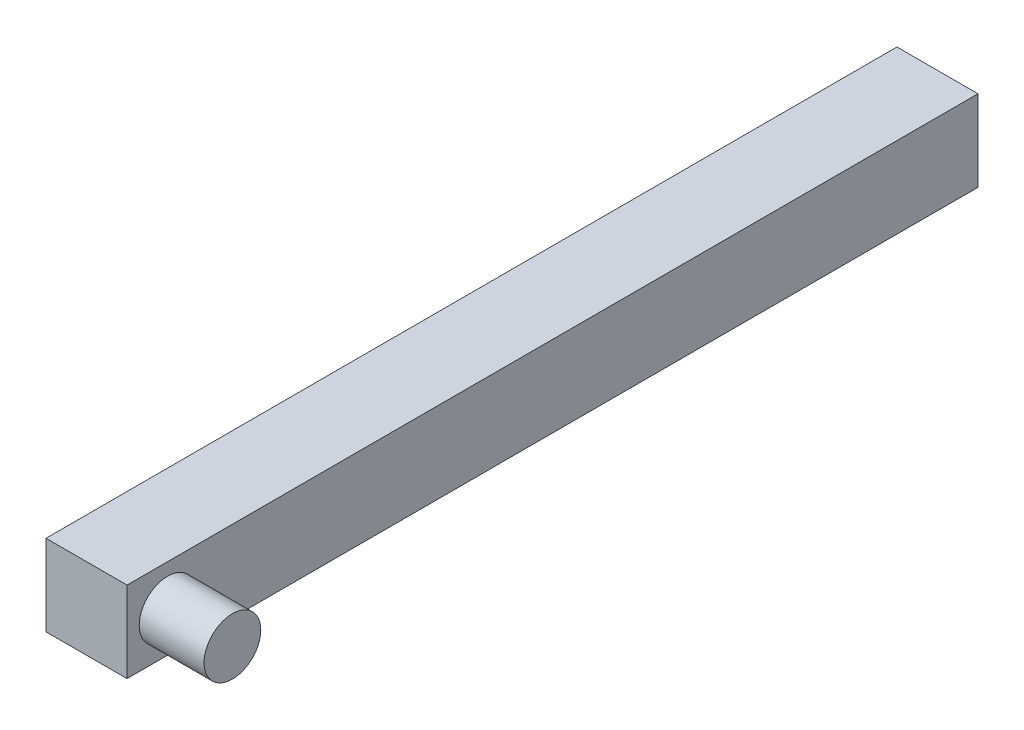
ISO-10303-21;
HEADER;
FILE_DESCRIPTION(('STEP AP214'),'2;1');
FILE_NAME('part.step','',(''),(''),'','','');
FILE_SCHEMA(('AUTOMOTIVE_DESIGN { 1 0 10303 214 1 1 1 1 }'));
ENDSEC;
DATA;
#1=APPLICATION_CONTEXT('core data for automotive mechanical design processes');
#2=APPLICATION_PROTOCOL_DEFINITION('international standard','automotive_design',2000,#1);
#3=PRODUCT_CONTEXT('',#1,'mechanical');
#4=PRODUCT('Part','Part','',(#3));
#5=PRODUCT_RELATED_PRODUCT_CATEGORY('part','',(#4));
#6=PRODUCT_DEFINITION_FORMATION('','',#4);
#7=PRODUCT_DEFINITION_CONTEXT('part definition',#1,'design');
#8=PRODUCT_DEFINITION('design','',#6,#7);
#9=PRODUCT_DEFINITION_SHAPE('','',#8);
#10=(LENGTH_UNIT() NAMED_UNIT(*) SI_UNIT(.MILLI.,.METRE.));
#11=(NAMED_UNIT(*) PLANE_ANGLE_UNIT() SI_UNIT($,.RADIAN.));
#12=(NAMED_UNIT(*) SI_UNIT($,.STERADIAN.) SOLID_ANGLE_UNIT());
#13=UNCERTAINTY_MEASURE_WITH_UNIT(LENGTH_MEASURE(1.E-05),#10,'distance_accuracy_value','');
#14=(GEOMETRIC_REPRESENTATION_CONTEXT(3) GLOBAL_UNCERTAINTY_ASSIGNED_CONTEXT((#13)) GLOBAL_UNIT_ASSIGNED_CONTEXT((#10,
#11,#12)) REPRESENTATION_CONTEXT('',''));
#15=CARTESIAN_POINT('',(0.,0.,0.));
#16=DIRECTION('',(0.,0.,1.));
#17=DIRECTION('',(1.,0.,0.));
#18=AXIS2_PLACEMENT_3D('',#15,#16,#17);
#19=CARTESIAN_POINT('',(0.,0.,205.));
#20=DIRECTION('',(1.,0.,0.));
#21=DIRECTION('',(0.,1.,0.));
#22=AXIS2_PLACEMENT_3D('',#19,#20,#21);
#23=PLANE('',#22);
#24=DIRECTION('',(0.,1.,0.));
#25=VECTOR('',#24,1.);
#26=CARTESIAN_POINT('',(0.,0.,100.));
#27=LINE('',#26,#25);
#28=CARTESIAN_POINT('',(0.,-10.,100.));
#29=VERTEX_POINT('',#28);
#30=CARTESIAN_POINT('',(0.,0.,100.));
#31=VERTEX_POINT('',#30);
#32=EDGE_CURVE('E55',#29,#31,#27,.T.);
#33=ORIENTED_EDGE('',*,*,#32,.F.);
#34=DIRECTION('',(0.,0.,-1.));
#35=VECTOR('',#34,1.);
#36=CARTESIAN_POINT('',(0.,-10.,205.));
#37=LINE('',#36,#35);
#38=CARTESIAN_POINT('',(0.,-10.,205.));
#39=VERTEX_POINT('',#38);
#40=EDGE_CURVE('E48',#39,#29,#37,.T.);
#41=ORIENTED_EDGE('',*,*,#40,.F.);
#42=DIRECTION('',(0.,-1.,0.));
#43=VECTOR('',#42,1.);
#44=CARTESIAN_POINT('',(0.,0.,205.));
#45=LINE('',#44,#43);
#46=CARTESIAN_POINT('',(0.,0.,205.));
#47=VERTEX_POINT('',#46);
#48=EDGE_CURVE('E111',#47,#39,#45,.T.);
#49=ORIENTED_EDGE('',*,*,#48,.F.);
#50=DIRECTION('',(0.,0.,-1.));
#51=VECTOR('',#50,1.);
#52=CARTESIAN_POINT('',(0.,0.,205.));
#53=LINE('',#52,#51);
#54=EDGE_CURVE('E102',#47,#31,#53,.T.);
#55=ORIENTED_EDGE('',*,*,#54,.T.);
#56=EDGE_LOOP('',(#33,#41,#49,#55));
#57=FACE_BOUND('',#56,.T.);
#58=ADVANCED_FACE('F41',(#57),#23,.F.);
#59=CARTESIAN_POINT('',(0.,-10.,205.));
#60=DIRECTION('',(0.,1.,0.));
#61=DIRECTION('',(0.,0.,1.));
#62=AXIS2_PLACEMENT_3D('',#59,#60,#61);
#63=PLANE('',#62);
#64=DIRECTION('',(-1.,0.,0.));
#65=VECTOR('',#64,1.);
#66=CARTESIAN_POINT('',(10.,-10.,100.));
#67=LINE('',#66,#65);
#68=CARTESIAN_POINT('',(10.,-10.,100.));
#69=VERTEX_POINT('',#68);
#70=EDGE_CURVE('E83',#69,#29,#67,.T.);
#71=ORIENTED_EDGE('',*,*,#70,.F.);
#72=DIRECTION('',(0.,0.,-1.));
#73=VECTOR('',#72,1.);
#74=CARTESIAN_POINT('',(10.,-10.,205.));
#75=LINE('',#74,#73);
#76=CARTESIAN_POINT('',(10.,-10.,205.));
#77=VERTEX_POINT('',#76);
#78=EDGE_CURVE('E94',#77,#69,#75,.T.);
#79=ORIENTED_EDGE('',*,*,#78,.F.);
#80=DIRECTION('',(1.,0.,0.));
#81=VECTOR('',#80,1.);
#82=CARTESIAN_POINT('',(0.,-10.,205.));
#83=LINE('',#82,#81);
#84=EDGE_CURVE('E109',#39,#77,#83,.T.);
#85=ORIENTED_EDGE('',*,*,#84,.F.);
#86=ORIENTED_EDGE('',*,*,#40,.T.);
#87=EDGE_LOOP('',(#71,#79,#85,#86));
#88=FACE_BOUND('',#87,.T.);
#89=ADVANCED_FACE('F93',(#88),#63,.F.);
#90=CARTESIAN_POINT('',(10.,0.,205.));
#91=DIRECTION('',(-1.,0.,0.));
#92=DIRECTION('',(0.,-1.,0.));
#93=AXIS2_PLACEMENT_3D('',#90,#91,#92);
#94=PLANE('',#93);
#95=CARTESIAN_POINT('',(10.,-5.05395080374806,200.));
#96=DIRECTION('',(-1.,0.,0.));
#97=DIRECTION('',(0.,-1.,0.));
#98=AXIS2_PLACEMENT_3D('',#95,#96,#97);
#99=CIRCLE('',#98,3.49999999999999);
#100=CARTESIAN_POINT('',(10.,-8.55395080374805,200.));
#101=VERTEX_POINT('',#100);
#102=EDGE_CURVE('E11',#101,#101,#99,.F.);
#103=ORIENTED_EDGE('',*,*,#102,.F.);
#104=EDGE_LOOP('',(#103));
#105=FACE_BOUND('',#104,.T.);
#106=DIRECTION('',(0.,-1.,0.));
#107=VECTOR('',#106,1.);
#108=CARTESIAN_POINT('',(10.,0.,100.));
#109=LINE('',#108,#107);
#110=CARTESIAN_POINT('',(10.,0.,100.));
#111=VERTEX_POINT('',#110);
#112=EDGE_CURVE('E80',#111,#69,#109,.T.);
#113=ORIENTED_EDGE('',*,*,#112,.F.);
#114=DIRECTION('',(0.,0.,-1.));
#115=VECTOR('',#114,1.);
#116=CARTESIAN_POINT('',(10.,0.,205.));
#117=LINE('',#116,#115);
#118=CARTESIAN_POINT('',(10.,0.,205.));
#119=VERTEX_POINT('',#118);
#120=EDGE_CURVE('E100',#119,#111,#117,.T.);
#121=ORIENTED_EDGE('',*,*,#120,.F.);
#122=DIRECTION('',(0.,1.,0.));
#123=VECTOR('',#122,1.);
#124=CARTESIAN_POINT('',(10.,0.,205.));
#125=LINE('',#124,#123);
#126=EDGE_CURVE('E99',#77,#119,#125,.T.);
#127=ORIENTED_EDGE('',*,*,#126,.F.);
#128=ORIENTED_EDGE('',*,*,#78,.T.);
#129=EDGE_LOOP('',(#113,#121,#127,#128));
#130=FACE_BOUND('',#129,.T.);
#131=ADVANCED_FACE('F98',(#105,#130),#94,.F.);
#132=CARTESIAN_POINT('',(0.,0.,205.));
#133=DIRECTION('',(0.,-1.,0.));
#134=DIRECTION('',(0.,0.,-1.));
#135=AXIS2_PLACEMENT_3D('',#132,#133,#134);
#136=PLANE('',#135);
#137=DIRECTION('',(1.,0.,0.));
#138=VECTOR('',#137,1.);
#139=CARTESIAN_POINT('',(10.,0.,100.));
#140=LINE('',#139,#138);
#141=EDGE_CURVE('E84',#31,#111,#140,.T.);
#142=ORIENTED_EDGE('',*,*,#141,.F.);
#143=ORIENTED_EDGE('',*,*,#54,.F.);
#144=DIRECTION('',(-1.,0.,0.));
#145=VECTOR('',#144,1.);
#146=CARTESIAN_POINT('',(0.,0.,205.));
#147=LINE('',#146,#145);
#148=EDGE_CURVE('E63',#119,#47,#147,.T.);
#149=ORIENTED_EDGE('',*,*,#148,.F.);
#150=ORIENTED_EDGE('',*,*,#120,.T.);
#151=EDGE_LOOP('',(#142,#143,#149,#150));
#152=FACE_BOUND('',#151,.T.);
#153=ADVANCED_FACE('F129',(#152),#136,.F.);
#154=CARTESIAN_POINT('',(0.,0.,205.));
#155=DIRECTION('',(0.,0.,1.));
#156=DIRECTION('',(1.,0.,0.));
#157=AXIS2_PLACEMENT_3D('',#154,#155,#156);
#158=PLANE('',#157);
#159=ORIENTED_EDGE('',*,*,#48,.T.);
#160=ORIENTED_EDGE('',*,*,#84,.T.);
#161=ORIENTED_EDGE('',*,*,#126,.T.);
#162=ORIENTED_EDGE('',*,*,#148,.T.);
#163=EDGE_LOOP('',(#159,#160,#161,#162));
#164=FACE_BOUND('',#163,.T.);
#165=ADVANCED_FACE('F124',(#164),#158,.T.);
#166=CARTESIAN_POINT('',(18.,-5.05395080374806,200.));
#167=DIRECTION('',(-1.,0.,0.));
#168=DIRECTION('',(0.,-1.,0.));
#169=AXIS2_PLACEMENT_3D('',#166,#167,#168);
#170=CYLINDRICAL_SURFACE('',#169,3.49999999999999);
#171=CARTESIAN_POINT('',(18.,-5.05395080374806,200.));
#172=DIRECTION('',(1.,0.,0.));
#173=DIRECTION('',(0.,1.,0.));
#174=AXIS2_PLACEMENT_3D('',#171,#172,#173);
#175=CIRCLE('',#174,3.49999999999999);
#176=CARTESIAN_POINT('',(18.,-1.55395080374807,200.));
#177=VERTEX_POINT('',#176);
#178=EDGE_CURVE('E113',#177,#177,#175,.T.);
#179=ORIENTED_EDGE('',*,*,#178,.F.);
#180=EDGE_LOOP('',(#179));
#181=FACE_BOUND('',#180,.T.);
#182=ORIENTED_EDGE('',*,*,#102,.T.);
#183=EDGE_LOOP('',(#182));
#184=FACE_BOUND('',#183,.T.);
#185=ADVANCED_FACE('F121',(#181,#184),#170,.T.);
#186=CARTESIAN_POINT('',(18.,-5.05395080374806,200.));
#187=DIRECTION('',(1.,0.,0.));
#188=DIRECTION('',(0.,1.,0.));
#189=AXIS2_PLACEMENT_3D('',#186,#187,#188);
#190=PLANE('',#189);
#191=ORIENTED_EDGE('',*,*,#178,.T.);
#192=EDGE_LOOP('',(#191));
#193=FACE_BOUND('',#192,.T.);
#194=ADVANCED_FACE('F119',(#193),#190,.T.);
#195=CARTESIAN_POINT('',(0.,0.,100.));
#196=DIRECTION('',(0.,0.,-1.));
#197=DIRECTION('',(-1.,0.,0.));
#198=AXIS2_PLACEMENT_3D('',#195,#196,#197);
#199=PLANE('',#198);
#200=ORIENTED_EDGE('',*,*,#112,.T.);
#201=ORIENTED_EDGE('',*,*,#70,.T.);
#202=ORIENTED_EDGE('',*,*,#32,.T.);
#203=ORIENTED_EDGE('',*,*,#141,.T.);
#204=EDGE_LOOP('',(#200,#201,#202,#203));
#205=FACE_BOUND('',#204,.T.);
#206=ADVANCED_FACE('F82',(#205),#199,.T.);
#207=CLOSED_SHELL('',(#58,#89,#131,#153,#165,#185,#194,#206));
#208=MANIFOLD_SOLID_BREP('B2',#207);
#209=ADVANCED_BREP_SHAPE_REPRESENTATION('',(#18,#208),#14);
#210=SHAPE_DEFINITION_REPRESENTATION(#9,#209);
ENDSEC;
END-ISO-10303-21;
